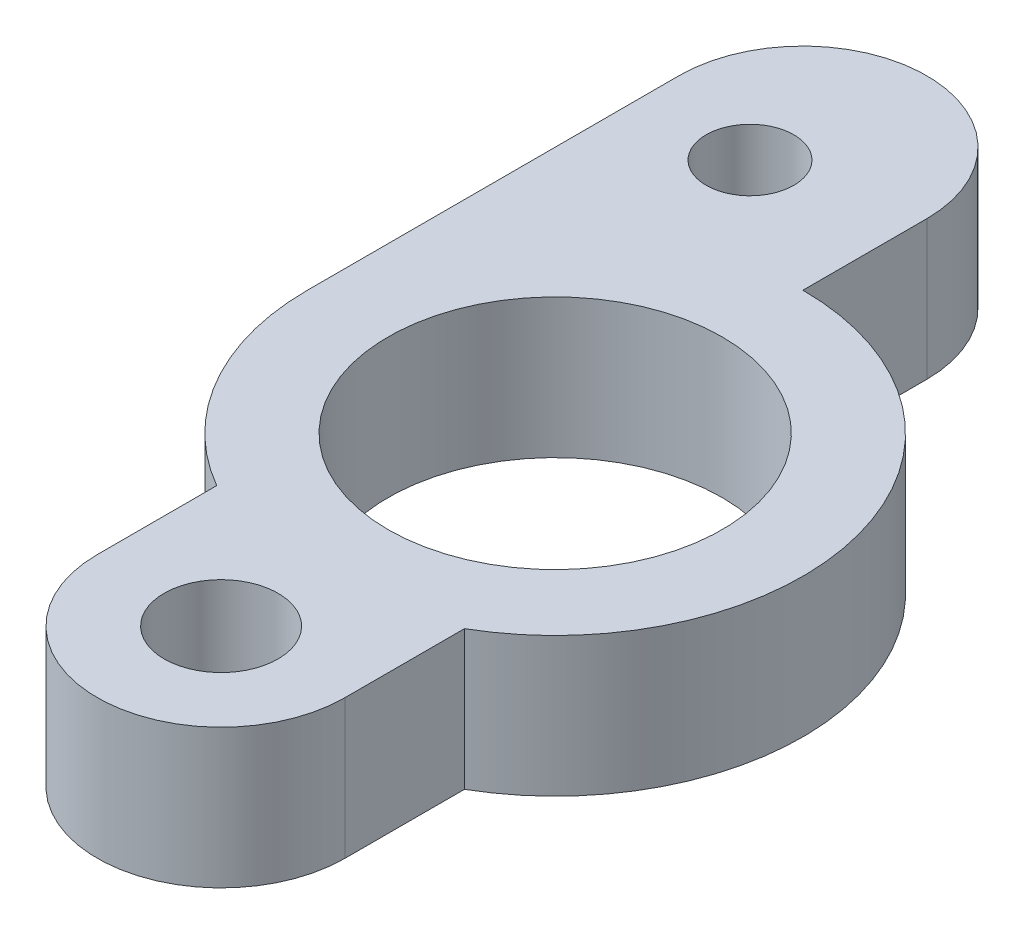
ISO-10303-21;
HEADER;
FILE_DESCRIPTION(('STEP AP214'),'2;1');
FILE_NAME('part.step','',(''),(''),'','','');
FILE_SCHEMA(('AUTOMOTIVE_DESIGN { 1 0 10303 214 1 1 1 1 }'));
ENDSEC;
DATA;
#1=APPLICATION_CONTEXT('core data for automotive mechanical design processes');
#2=APPLICATION_PROTOCOL_DEFINITION('international standard','automotive_design',2000,#1);
#3=PRODUCT_CONTEXT('',#1,'mechanical');
#4=PRODUCT('Part','Part','',(#3));
#5=PRODUCT_RELATED_PRODUCT_CATEGORY('part','',(#4));
#6=PRODUCT_DEFINITION_FORMATION('','',#4);
#7=PRODUCT_DEFINITION_CONTEXT('part definition',#1,'design');
#8=PRODUCT_DEFINITION('design','',#6,#7);
#9=PRODUCT_DEFINITION_SHAPE('','',#8);
#10=(LENGTH_UNIT() NAMED_UNIT(*) SI_UNIT(.MILLI.,.METRE.));
#11=(NAMED_UNIT(*) PLANE_ANGLE_UNIT() SI_UNIT($,.RADIAN.));
#12=(NAMED_UNIT(*) SI_UNIT($,.STERADIAN.) SOLID_ANGLE_UNIT());
#13=UNCERTAINTY_MEASURE_WITH_UNIT(LENGTH_MEASURE(1.E-05),#10,'distance_accuracy_value','');
#14=(GEOMETRIC_REPRESENTATION_CONTEXT(3) GLOBAL_UNCERTAINTY_ASSIGNED_CONTEXT((#13)) GLOBAL_UNIT_ASSIGNED_CONTEXT((#10,
#11,#12)) REPRESENTATION_CONTEXT('',''));
#15=CARTESIAN_POINT('',(0.,0.,0.));
#16=DIRECTION('',(0.,0.,1.));
#17=DIRECTION('',(1.,0.,0.));
#18=AXIS2_PLACEMENT_3D('',#15,#16,#17);
#19=CARTESIAN_POINT('',(0.,6.35,0.));
#20=DIRECTION('',(0.,1.,0.));
#21=DIRECTION('',(0.,0.,1.));
#22=AXIS2_PLACEMENT_3D('',#19,#20,#21);
#23=PLANE('',#22);
#24=CARTESIAN_POINT('',(-6.35,6.35,-15.24));
#25=DIRECTION('',(0.,1.,0.));
#26=DIRECTION('',(0.,0.,1.));
#27=AXIS2_PLACEMENT_3D('',#24,#25,#26);
#28=CIRCLE('',#27,2.);
#29=CARTESIAN_POINT('',(-6.35,6.35,-13.24));
#30=VERTEX_POINT('',#29);
#31=EDGE_CURVE('E182',#30,#30,#28,.T.);
#32=ORIENTED_EDGE('',*,*,#31,.F.);
#33=EDGE_LOOP('',(#32));
#34=FACE_BOUND('',#33,.T.);
#35=CARTESIAN_POINT('',(0.,6.35,0.));
#36=DIRECTION('',(0.,1.,0.));
#37=DIRECTION('',(0.,0.,1.));
#38=AXIS2_PLACEMENT_3D('',#35,#36,#37);
#39=CIRCLE('',#38,11.303);
#40=CARTESIAN_POINT('',(-11.303,6.35,0.));
#41=VERTEX_POINT('',#40);
#42=CARTESIAN_POINT('',(-5.6515,6.35,9.78868513897551));
#43=VERTEX_POINT('',#42);
#44=EDGE_CURVE('E145',#41,#43,#39,.T.);
#45=ORIENTED_EDGE('',*,*,#44,.T.);
#46=DIRECTION('',(0.,0.,1.));
#47=VECTOR('',#46,1.);
#48=CARTESIAN_POINT('',(-5.6515,6.35,9.78868513897551));
#49=LINE('',#48,#47);
#50=CARTESIAN_POINT('',(-5.6515,6.35,15.24));
#51=VERTEX_POINT('',#50);
#52=EDGE_CURVE('E93',#43,#51,#49,.T.);
#53=ORIENTED_EDGE('',*,*,#52,.T.);
#54=CARTESIAN_POINT('',(0.,6.35,15.24));
#55=DIRECTION('',(0.,1.,0.));
#56=DIRECTION('',(0.,0.,1.));
#57=AXIS2_PLACEMENT_3D('',#54,#55,#56);
#58=CIRCLE('',#57,5.6515);
#59=CARTESIAN_POINT('',(5.6515,6.35,15.24));
#60=VERTEX_POINT('',#59);
#61=EDGE_CURVE('E160',#51,#60,#58,.T.);
#62=ORIENTED_EDGE('',*,*,#61,.T.);
#63=DIRECTION('',(0.,0.,-1.));
#64=VECTOR('',#63,1.);
#65=CARTESIAN_POINT('',(5.6515,6.35,9.78868513897551));
#66=LINE('',#65,#64);
#67=CARTESIAN_POINT('',(5.6515,6.35,9.78868513897551));
#68=VERTEX_POINT('',#67);
#69=EDGE_CURVE('E173',#60,#68,#66,.T.);
#70=ORIENTED_EDGE('',*,*,#69,.T.);
#71=CARTESIAN_POINT('',(0.,6.35,0.));
#72=DIRECTION('',(0.,1.,0.));
#73=DIRECTION('',(0.,0.,1.));
#74=AXIS2_PLACEMENT_3D('',#71,#72,#73);
#75=CIRCLE('',#74,11.303);
#76=CARTESIAN_POINT('',(0.,6.35,-11.303));
#77=VERTEX_POINT('',#76);
#78=EDGE_CURVE('E112',#68,#77,#75,.T.);
#79=ORIENTED_EDGE('',*,*,#78,.T.);
#80=DIRECTION('',(0.,0.,-1.));
#81=VECTOR('',#80,1.);
#82=CARTESIAN_POINT('',(0.,6.35,-16.9544999999999));
#83=LINE('',#82,#81);
#84=CARTESIAN_POINT('',(0.,6.35,-16.9544999999999));
#85=VERTEX_POINT('',#84);
#86=EDGE_CURVE('E106',#77,#85,#83,.T.);
#87=ORIENTED_EDGE('',*,*,#86,.T.);
#88=CARTESIAN_POINT('',(-5.6515,6.35,-16.9544999999999));
#89=DIRECTION('',(0.,1.,0.));
#90=DIRECTION('',(0.,0.,1.));
#91=AXIS2_PLACEMENT_3D('',#88,#89,#90);
#92=CIRCLE('',#91,5.6515);
#93=CARTESIAN_POINT('',(-11.303,6.35,-16.9544999999999));
#94=VERTEX_POINT('',#93);
#95=EDGE_CURVE('E110',#85,#94,#92,.T.);
#96=ORIENTED_EDGE('',*,*,#95,.T.);
#97=DIRECTION('',(0.,0.,1.));
#98=VECTOR('',#97,1.);
#99=CARTESIAN_POINT('',(-11.303,6.35,-16.9544999999999));
#100=LINE('',#99,#98);
#101=EDGE_CURVE('E50',#94,#41,#100,.T.);
#102=ORIENTED_EDGE('',*,*,#101,.T.);
#103=EDGE_LOOP('',(#45,#53,#62,#70,#79,#87,#96,#102));
#104=FACE_BOUND('',#103,.T.);
#105=CARTESIAN_POINT('',(0.,6.35,0.));
#106=DIRECTION('',(0.,1.,0.));
#107=DIRECTION('',(0.,0.,1.));
#108=AXIS2_PLACEMENT_3D('',#105,#106,#107);
#109=CIRCLE('',#108,7.62);
#110=CARTESIAN_POINT('',(0.,6.35,7.62));
#111=VERTEX_POINT('',#110);
#112=EDGE_CURVE('E134',#111,#111,#109,.T.);
#113=ORIENTED_EDGE('',*,*,#112,.F.);
#114=EDGE_LOOP('',(#113));
#115=FACE_BOUND('',#114,.T.);
#116=CARTESIAN_POINT('',(0.,6.35,15.24));
#117=DIRECTION('',(0.,1.,0.));
#118=DIRECTION('',(0.,0.,1.));
#119=AXIS2_PLACEMENT_3D('',#116,#117,#118);
#120=CIRCLE('',#119,2.59791906126355);
#121=CARTESIAN_POINT('',(0.,6.35,17.8379190612636));
#122=VERTEX_POINT('',#121);
#123=EDGE_CURVE('E188',#122,#122,#120,.T.);
#124=ORIENTED_EDGE('',*,*,#123,.F.);
#125=EDGE_LOOP('',(#124));
#126=FACE_BOUND('',#125,.T.);
#127=ADVANCED_FACE('F33',(#34,#104,#115,#126),#23,.T.);
#128=CARTESIAN_POINT('',(0.,0.,0.));
#129=DIRECTION('',(0.,1.,0.));
#130=DIRECTION('',(0.,0.,1.));
#131=AXIS2_PLACEMENT_3D('',#128,#129,#130);
#132=PLANE('',#131);
#133=CARTESIAN_POINT('',(0.,0.,0.));
#134=DIRECTION('',(0.,1.,0.));
#135=DIRECTION('',(0.,0.,1.));
#136=AXIS2_PLACEMENT_3D('',#133,#134,#135);
#137=CIRCLE('',#136,11.303);
#138=CARTESIAN_POINT('',(-11.303,0.,0.));
#139=VERTEX_POINT('',#138);
#140=CARTESIAN_POINT('',(-5.6515,0.,9.78868513897551));
#141=VERTEX_POINT('',#140);
#142=EDGE_CURVE('E130',#139,#141,#137,.T.);
#143=ORIENTED_EDGE('',*,*,#142,.F.);
#144=DIRECTION('',(0.,0.,1.));
#145=VECTOR('',#144,1.);
#146=CARTESIAN_POINT('',(-11.303,0.,-16.9544999999999));
#147=LINE('',#146,#145);
#148=CARTESIAN_POINT('',(-11.303,0.,-16.9544999999999));
#149=VERTEX_POINT('',#148);
#150=EDGE_CURVE('E85',#149,#139,#147,.T.);
#151=ORIENTED_EDGE('',*,*,#150,.F.);
#152=CARTESIAN_POINT('',(-5.6515,0.,-16.9544999999999));
#153=DIRECTION('',(0.,1.,0.));
#154=DIRECTION('',(0.,0.,1.));
#155=AXIS2_PLACEMENT_3D('',#152,#153,#154);
#156=CIRCLE('',#155,5.6515);
#157=CARTESIAN_POINT('',(0.,0.,-16.9544999999999));
#158=VERTEX_POINT('',#157);
#159=EDGE_CURVE('E79',#158,#149,#156,.T.);
#160=ORIENTED_EDGE('',*,*,#159,.F.);
#161=DIRECTION('',(0.,0.,-1.));
#162=VECTOR('',#161,1.);
#163=CARTESIAN_POINT('',(0.,0.,-16.9544999999999));
#164=LINE('',#163,#162);
#165=CARTESIAN_POINT('',(0.,0.,-11.303));
#166=VERTEX_POINT('',#165);
#167=EDGE_CURVE('E120',#166,#158,#164,.T.);
#168=ORIENTED_EDGE('',*,*,#167,.F.);
#169=CARTESIAN_POINT('',(0.,0.,0.));
#170=DIRECTION('',(0.,1.,0.));
#171=DIRECTION('',(0.,0.,1.));
#172=AXIS2_PLACEMENT_3D('',#169,#170,#171);
#173=CIRCLE('',#172,11.303);
#174=CARTESIAN_POINT('',(5.6515,0.,9.78868513897551));
#175=VERTEX_POINT('',#174);
#176=EDGE_CURVE('E140',#175,#166,#173,.T.);
#177=ORIENTED_EDGE('',*,*,#176,.F.);
#178=DIRECTION('',(0.,0.,-1.));
#179=VECTOR('',#178,1.);
#180=CARTESIAN_POINT('',(5.6515,0.,9.78868513897551));
#181=LINE('',#180,#179);
#182=CARTESIAN_POINT('',(5.6515,0.,15.24));
#183=VERTEX_POINT('',#182);
#184=EDGE_CURVE('E138',#183,#175,#181,.T.);
#185=ORIENTED_EDGE('',*,*,#184,.F.);
#186=CARTESIAN_POINT('',(0.,0.,15.24));
#187=DIRECTION('',(0.,1.,0.));
#188=DIRECTION('',(0.,0.,1.));
#189=AXIS2_PLACEMENT_3D('',#186,#187,#188);
#190=CIRCLE('',#189,5.6515);
#191=CARTESIAN_POINT('',(-5.6515,0.,15.24));
#192=VERTEX_POINT('',#191);
#193=EDGE_CURVE('E136',#192,#183,#190,.T.);
#194=ORIENTED_EDGE('',*,*,#193,.F.);
#195=DIRECTION('',(0.,0.,1.));
#196=VECTOR('',#195,1.);
#197=CARTESIAN_POINT('',(-5.6515,0.,9.78868513897551));
#198=LINE('',#197,#196);
#199=EDGE_CURVE('E133',#141,#192,#198,.T.);
#200=ORIENTED_EDGE('',*,*,#199,.F.);
#201=EDGE_LOOP('',(#143,#151,#160,#168,#177,#185,#194,#200));
#202=FACE_BOUND('',#201,.T.);
#203=CARTESIAN_POINT('',(0.,0.,0.));
#204=DIRECTION('',(0.,1.,0.));
#205=DIRECTION('',(0.,0.,1.));
#206=AXIS2_PLACEMENT_3D('',#203,#204,#205);
#207=CIRCLE('',#206,7.62);
#208=CARTESIAN_POINT('',(0.,0.,7.62));
#209=VERTEX_POINT('',#208);
#210=EDGE_CURVE('E179',#209,#209,#207,.T.);
#211=ORIENTED_EDGE('',*,*,#210,.T.);
#212=EDGE_LOOP('',(#211));
#213=FACE_BOUND('',#212,.T.);
#214=CARTESIAN_POINT('',(-6.35,0.,-15.24));
#215=DIRECTION('',(0.,1.,0.));
#216=DIRECTION('',(0.,0.,1.));
#217=AXIS2_PLACEMENT_3D('',#214,#215,#216);
#218=CIRCLE('',#217,2.);
#219=CARTESIAN_POINT('',(-6.35,0.,-13.24));
#220=VERTEX_POINT('',#219);
#221=EDGE_CURVE('E185',#220,#220,#218,.T.);
#222=ORIENTED_EDGE('',*,*,#221,.T.);
#223=EDGE_LOOP('',(#222));
#224=FACE_BOUND('',#223,.T.);
#225=CARTESIAN_POINT('',(0.,0.,15.24));
#226=DIRECTION('',(0.,1.,0.));
#227=DIRECTION('',(0.,0.,1.));
#228=AXIS2_PLACEMENT_3D('',#225,#226,#227);
#229=CIRCLE('',#228,2.59791906126355);
#230=CARTESIAN_POINT('',(0.,0.,17.8379190612636));
#231=VERTEX_POINT('',#230);
#232=EDGE_CURVE('E191',#231,#231,#229,.T.);
#233=ORIENTED_EDGE('',*,*,#232,.T.);
#234=EDGE_LOOP('',(#233));
#235=FACE_BOUND('',#234,.T.);
#236=ADVANCED_FACE('F164',(#202,#213,#224,#235),#132,.F.);
#237=CARTESIAN_POINT('',(0.,6.35,0.));
#238=DIRECTION('',(0.,-1.,0.));
#239=DIRECTION('',(0.,0.,-1.));
#240=AXIS2_PLACEMENT_3D('',#237,#238,#239);
#241=CYLINDRICAL_SURFACE('',#240,11.303);
#242=ORIENTED_EDGE('',*,*,#142,.T.);
#243=DIRECTION('',(0.,-1.,0.));
#244=VECTOR('',#243,1.);
#245=CARTESIAN_POINT('',(-5.6515,6.35,9.78868513897551));
#246=LINE('',#245,#244);
#247=EDGE_CURVE('E11',#43,#141,#246,.T.);
#248=ORIENTED_EDGE('',*,*,#247,.F.);
#249=ORIENTED_EDGE('',*,*,#44,.F.);
#250=DIRECTION('',(0.,-1.,0.));
#251=VECTOR('',#250,1.);
#252=CARTESIAN_POINT('',(-11.303,6.35,0.));
#253=LINE('',#252,#251);
#254=EDGE_CURVE('E126',#41,#139,#253,.T.);
#255=ORIENTED_EDGE('',*,*,#254,.T.);
#256=EDGE_LOOP('',(#242,#248,#249,#255));
#257=FACE_BOUND('',#256,.T.);
#258=ADVANCED_FACE('F35',(#257),#241,.T.);
#259=CARTESIAN_POINT('',(-5.6515,6.35,9.78868513897551));
#260=DIRECTION('',(1.,0.,0.));
#261=DIRECTION('',(0.,0.,-1.));
#262=AXIS2_PLACEMENT_3D('',#259,#260,#261);
#263=PLANE('',#262);
#264=ORIENTED_EDGE('',*,*,#199,.T.);
#265=DIRECTION('',(0.,-1.,0.));
#266=VECTOR('',#265,1.);
#267=CARTESIAN_POINT('',(-5.6515,6.35,15.24));
#268=LINE('',#267,#266);
#269=EDGE_CURVE('E42',#51,#192,#268,.T.);
#270=ORIENTED_EDGE('',*,*,#269,.F.);
#271=ORIENTED_EDGE('',*,*,#52,.F.);
#272=ORIENTED_EDGE('',*,*,#247,.T.);
#273=EDGE_LOOP('',(#264,#270,#271,#272));
#274=FACE_BOUND('',#273,.T.);
#275=ADVANCED_FACE('F224',(#274),#263,.F.);
#276=CARTESIAN_POINT('',(0.,6.35,15.24));
#277=DIRECTION('',(0.,-1.,0.));
#278=DIRECTION('',(0.,0.,-1.));
#279=AXIS2_PLACEMENT_3D('',#276,#277,#278);
#280=CYLINDRICAL_SURFACE('',#279,5.6515);
#281=ORIENTED_EDGE('',*,*,#193,.T.);
#282=DIRECTION('',(0.,-1.,0.));
#283=VECTOR('',#282,1.);
#284=CARTESIAN_POINT('',(5.6515,6.35,15.24));
#285=LINE('',#284,#283);
#286=EDGE_CURVE('E152',#60,#183,#285,.T.);
#287=ORIENTED_EDGE('',*,*,#286,.F.);
#288=ORIENTED_EDGE('',*,*,#61,.F.);
#289=ORIENTED_EDGE('',*,*,#269,.T.);
#290=EDGE_LOOP('',(#281,#287,#288,#289));
#291=FACE_BOUND('',#290,.T.);
#292=ADVANCED_FACE('F158',(#291),#280,.T.);
#293=CARTESIAN_POINT('',(5.6515,6.35,9.78868513897551));
#294=DIRECTION('',(-1.,0.,0.));
#295=DIRECTION('',(0.,0.,1.));
#296=AXIS2_PLACEMENT_3D('',#293,#294,#295);
#297=PLANE('',#296);
#298=ORIENTED_EDGE('',*,*,#184,.T.);
#299=DIRECTION('',(0.,-1.,0.));
#300=VECTOR('',#299,1.);
#301=CARTESIAN_POINT('',(5.6515,6.35,9.78868513897551));
#302=LINE('',#301,#300);
#303=EDGE_CURVE('E149',#68,#175,#302,.T.);
#304=ORIENTED_EDGE('',*,*,#303,.F.);
#305=ORIENTED_EDGE('',*,*,#69,.F.);
#306=ORIENTED_EDGE('',*,*,#286,.T.);
#307=EDGE_LOOP('',(#298,#304,#305,#306));
#308=FACE_BOUND('',#307,.T.);
#309=ADVANCED_FACE('F169',(#308),#297,.F.);
#310=CARTESIAN_POINT('',(0.,6.35,0.));
#311=DIRECTION('',(0.,-1.,0.));
#312=DIRECTION('',(0.,0.,-1.));
#313=AXIS2_PLACEMENT_3D('',#310,#311,#312);
#314=CYLINDRICAL_SURFACE('',#313,11.303);
#315=ORIENTED_EDGE('',*,*,#176,.T.);
#316=DIRECTION('',(0.,-1.,0.));
#317=VECTOR('',#316,1.);
#318=CARTESIAN_POINT('',(0.,6.35,-11.303));
#319=LINE('',#318,#317);
#320=EDGE_CURVE('E121',#77,#166,#319,.T.);
#321=ORIENTED_EDGE('',*,*,#320,.F.);
#322=ORIENTED_EDGE('',*,*,#78,.F.);
#323=ORIENTED_EDGE('',*,*,#303,.T.);
#324=EDGE_LOOP('',(#315,#321,#322,#323));
#325=FACE_BOUND('',#324,.T.);
#326=ADVANCED_FACE('F172',(#325),#314,.T.);
#327=CARTESIAN_POINT('',(0.,6.35,-16.9544999999999));
#328=DIRECTION('',(-1.,0.,0.));
#329=DIRECTION('',(0.,0.,1.));
#330=AXIS2_PLACEMENT_3D('',#327,#328,#329);
#331=PLANE('',#330);
#332=ORIENTED_EDGE('',*,*,#167,.T.);
#333=DIRECTION('',(0.,-1.,0.));
#334=VECTOR('',#333,1.);
#335=CARTESIAN_POINT('',(0.,6.35,-16.9544999999999));
#336=LINE('',#335,#334);
#337=EDGE_CURVE('E117',#85,#158,#336,.T.);
#338=ORIENTED_EDGE('',*,*,#337,.F.);
#339=ORIENTED_EDGE('',*,*,#86,.F.);
#340=ORIENTED_EDGE('',*,*,#320,.T.);
#341=EDGE_LOOP('',(#332,#338,#339,#340));
#342=FACE_BOUND('',#341,.T.);
#343=ADVANCED_FACE('F118',(#342),#331,.F.);
#344=CARTESIAN_POINT('',(-5.6515,6.35,-16.9544999999999));
#345=DIRECTION('',(0.,-1.,0.));
#346=DIRECTION('',(0.,0.,-1.));
#347=AXIS2_PLACEMENT_3D('',#344,#345,#346);
#348=CYLINDRICAL_SURFACE('',#347,5.6515);
#349=ORIENTED_EDGE('',*,*,#159,.T.);
#350=DIRECTION('',(0.,-1.,0.));
#351=VECTOR('',#350,1.);
#352=CARTESIAN_POINT('',(-11.303,6.35,-16.9544999999999));
#353=LINE('',#352,#351);
#354=EDGE_CURVE('E122',#94,#149,#353,.T.);
#355=ORIENTED_EDGE('',*,*,#354,.F.);
#356=ORIENTED_EDGE('',*,*,#95,.F.);
#357=ORIENTED_EDGE('',*,*,#337,.T.);
#358=EDGE_LOOP('',(#349,#355,#356,#357));
#359=FACE_BOUND('',#358,.T.);
#360=ADVANCED_FACE('F124',(#359),#348,.T.);
#361=CARTESIAN_POINT('',(-11.303,6.35,-16.9544999999999));
#362=DIRECTION('',(1.,0.,0.));
#363=DIRECTION('',(0.,0.,-1.));
#364=AXIS2_PLACEMENT_3D('',#361,#362,#363);
#365=PLANE('',#364);
#366=ORIENTED_EDGE('',*,*,#150,.T.);
#367=ORIENTED_EDGE('',*,*,#254,.F.);
#368=ORIENTED_EDGE('',*,*,#101,.F.);
#369=ORIENTED_EDGE('',*,*,#354,.T.);
#370=EDGE_LOOP('',(#366,#367,#368,#369));
#371=FACE_BOUND('',#370,.T.);
#372=ADVANCED_FACE('F212',(#371),#365,.F.);
#373=CARTESIAN_POINT('',(0.,6.35,0.));
#374=DIRECTION('',(0.,-1.,0.));
#375=DIRECTION('',(0.,0.,-1.));
#376=AXIS2_PLACEMENT_3D('',#373,#374,#375);
#377=CYLINDRICAL_SURFACE('',#376,7.62);
#378=ORIENTED_EDGE('',*,*,#112,.T.);
#379=EDGE_LOOP('',(#378));
#380=FACE_BOUND('',#379,.T.);
#381=ORIENTED_EDGE('',*,*,#210,.F.);
#382=EDGE_LOOP('',(#381));
#383=FACE_BOUND('',#382,.T.);
#384=ADVANCED_FACE('F209',(#380,#383),#377,.F.);
#385=CARTESIAN_POINT('',(-6.35,6.35,-15.24));
#386=DIRECTION('',(0.,-1.,0.));
#387=DIRECTION('',(0.,0.,-1.));
#388=AXIS2_PLACEMENT_3D('',#385,#386,#387);
#389=CYLINDRICAL_SURFACE('',#388,2.);
#390=ORIENTED_EDGE('',*,*,#31,.T.);
#391=EDGE_LOOP('',(#390));
#392=FACE_BOUND('',#391,.T.);
#393=ORIENTED_EDGE('',*,*,#221,.F.);
#394=EDGE_LOOP('',(#393));
#395=FACE_BOUND('',#394,.T.);
#396=ADVANCED_FACE('F288',(#392,#395),#389,.F.);
#397=CARTESIAN_POINT('',(0.,6.35,15.24));
#398=DIRECTION('',(0.,-1.,0.));
#399=DIRECTION('',(0.,0.,-1.));
#400=AXIS2_PLACEMENT_3D('',#397,#398,#399);
#401=CYLINDRICAL_SURFACE('',#400,2.59791906126355);
#402=ORIENTED_EDGE('',*,*,#123,.T.);
#403=EDGE_LOOP('',(#402));
#404=FACE_BOUND('',#403,.T.);
#405=ORIENTED_EDGE('',*,*,#232,.F.);
#406=EDGE_LOOP('',(#405));
#407=FACE_BOUND('',#406,.T.);
#408=ADVANCED_FACE('F197',(#404,#407),#401,.F.);
#409=CLOSED_SHELL('',(#127,#236,#258,#275,#292,#309,#326,#343,#360,#372,#384,#396,#408));
#410=MANIFOLD_SOLID_BREP('B2',#409);
#411=ADVANCED_BREP_SHAPE_REPRESENTATION('',(#18,#410),#14);
#412=SHAPE_DEFINITION_REPRESENTATION(#9,#411);
ENDSEC;
END-ISO-10303-21;
